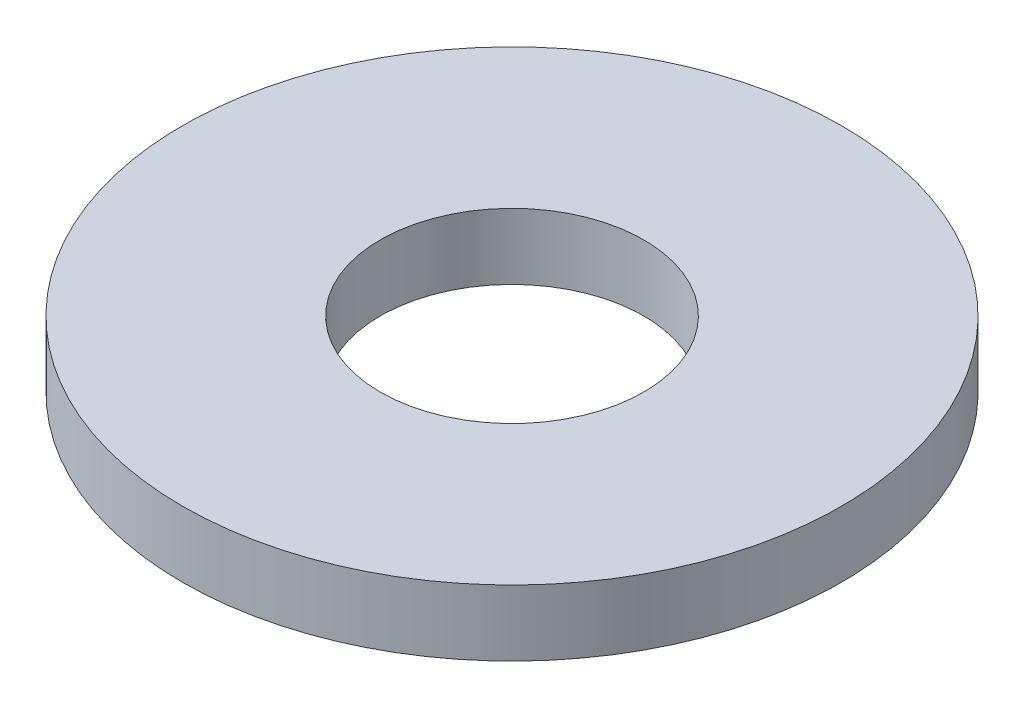
ISO-10303-21;
HEADER;
FILE_DESCRIPTION(('STEP AP214'),'2;1');
FILE_NAME('part.step','',(''),(''),'','','');
FILE_SCHEMA(('AUTOMOTIVE_DESIGN { 1 0 10303 214 1 1 1 1 }'));
ENDSEC;
DATA;
#1=APPLICATION_CONTEXT('core data for automotive mechanical design processes');
#2=APPLICATION_PROTOCOL_DEFINITION('international standard','automotive_design',2000,#1);
#3=PRODUCT_CONTEXT('',#1,'mechanical');
#4=PRODUCT('Part','Part','',(#3));
#5=PRODUCT_RELATED_PRODUCT_CATEGORY('part','',(#4));
#6=PRODUCT_DEFINITION_FORMATION('','',#4);
#7=PRODUCT_DEFINITION_CONTEXT('part definition',#1,'design');
#8=PRODUCT_DEFINITION('design','',#6,#7);
#9=PRODUCT_DEFINITION_SHAPE('','',#8);
#10=(LENGTH_UNIT() NAMED_UNIT(*) SI_UNIT(.MILLI.,.METRE.));
#11=(NAMED_UNIT(*) PLANE_ANGLE_UNIT() SI_UNIT($,.RADIAN.));
#12=(NAMED_UNIT(*) SI_UNIT($,.STERADIAN.) SOLID_ANGLE_UNIT());
#13=UNCERTAINTY_MEASURE_WITH_UNIT(LENGTH_MEASURE(1.E-05),#10,'distance_accuracy_value','');
#14=(GEOMETRIC_REPRESENTATION_CONTEXT(3) GLOBAL_UNCERTAINTY_ASSIGNED_CONTEXT((#13)) GLOBAL_UNIT_ASSIGNED_CONTEXT((#10,
#11,#12)) REPRESENTATION_CONTEXT('',''));
#15=CARTESIAN_POINT('',(0.,0.,0.));
#16=DIRECTION('',(0.,0.,1.));
#17=DIRECTION('',(1.,0.,0.));
#18=AXIS2_PLACEMENT_3D('',#15,#16,#17);
#19=CARTESIAN_POINT('',(0.,1.5875,0.));
#20=DIRECTION('',(0.,1.,0.));
#21=DIRECTION('',(0.,0.,1.));
#22=AXIS2_PLACEMENT_3D('',#19,#20,#21);
#23=PLANE('',#22);
#24=CARTESIAN_POINT('',(0.,1.5875,0.));
#25=DIRECTION('',(0.,1.,0.));
#26=DIRECTION('',(0.,0.,1.));
#27=AXIS2_PLACEMENT_3D('',#24,#25,#26);
#28=CIRCLE('',#27,7.9375);
#29=CARTESIAN_POINT('',(0.,1.5875,7.9375));
#30=VERTEX_POINT('',#29);
#31=EDGE_CURVE('E10',#30,#30,#28,.T.);
#32=ORIENTED_EDGE('',*,*,#31,.T.);
#33=EDGE_LOOP('',(#32));
#34=FACE_BOUND('',#33,.T.);
#35=CARTESIAN_POINT('',(0.,1.5875,0.));
#36=DIRECTION('',(0.,1.,0.));
#37=DIRECTION('',(0.,0.,1.));
#38=AXIS2_PLACEMENT_3D('',#35,#36,#37);
#39=CIRCLE('',#38,3.175);
#40=CARTESIAN_POINT('',(0.,1.5875,3.175));
#41=VERTEX_POINT('',#40);
#42=EDGE_CURVE('E42',#41,#41,#39,.T.);
#43=ORIENTED_EDGE('',*,*,#42,.F.);
#44=EDGE_LOOP('',(#43));
#45=FACE_BOUND('',#44,.T.);
#46=ADVANCED_FACE('F31',(#34,#45),#23,.T.);
#47=CARTESIAN_POINT('',(0.,0.,0.));
#48=DIRECTION('',(0.,1.,0.));
#49=DIRECTION('',(0.,0.,1.));
#50=AXIS2_PLACEMENT_3D('',#47,#48,#49);
#51=PLANE('',#50);
#52=CARTESIAN_POINT('',(0.,0.,0.));
#53=DIRECTION('',(0.,1.,0.));
#54=DIRECTION('',(0.,0.,1.));
#55=AXIS2_PLACEMENT_3D('',#52,#53,#54);
#56=CIRCLE('',#55,7.9375);
#57=CARTESIAN_POINT('',(0.,0.,7.9375));
#58=VERTEX_POINT('',#57);
#59=EDGE_CURVE('E35',#58,#58,#56,.T.);
#60=ORIENTED_EDGE('',*,*,#59,.F.);
#61=EDGE_LOOP('',(#60));
#62=FACE_BOUND('',#61,.T.);
#63=CARTESIAN_POINT('',(0.,0.,0.));
#64=DIRECTION('',(0.,1.,0.));
#65=DIRECTION('',(0.,0.,1.));
#66=AXIS2_PLACEMENT_3D('',#63,#64,#65);
#67=CIRCLE('',#66,3.175);
#68=CARTESIAN_POINT('',(0.,0.,3.175));
#69=VERTEX_POINT('',#68);
#70=EDGE_CURVE('E44',#69,#69,#67,.T.);
#71=ORIENTED_EDGE('',*,*,#70,.T.);
#72=EDGE_LOOP('',(#71));
#73=FACE_BOUND('',#72,.T.);
#74=ADVANCED_FACE('F54',(#62,#73),#51,.F.);
#75=CARTESIAN_POINT('',(0.,1.5875,0.));
#76=DIRECTION('',(0.,-1.,0.));
#77=DIRECTION('',(0.,0.,-1.));
#78=AXIS2_PLACEMENT_3D('',#75,#76,#77);
#79=CYLINDRICAL_SURFACE('',#78,7.9375);
#80=ORIENTED_EDGE('',*,*,#31,.F.);
#81=EDGE_LOOP('',(#80));
#82=FACE_BOUND('',#81,.T.);
#83=ORIENTED_EDGE('',*,*,#59,.T.);
#84=EDGE_LOOP('',(#83));
#85=FACE_BOUND('',#84,.T.);
#86=ADVANCED_FACE('F33',(#82,#85),#79,.T.);
#87=CARTESIAN_POINT('',(0.,1.5875,0.));
#88=DIRECTION('',(0.,-1.,0.));
#89=DIRECTION('',(0.,0.,-1.));
#90=AXIS2_PLACEMENT_3D('',#87,#88,#89);
#91=CYLINDRICAL_SURFACE('',#90,3.175);
#92=ORIENTED_EDGE('',*,*,#42,.T.);
#93=EDGE_LOOP('',(#92));
#94=FACE_BOUND('',#93,.T.);
#95=ORIENTED_EDGE('',*,*,#70,.F.);
#96=EDGE_LOOP('',(#95));
#97=FACE_BOUND('',#96,.T.);
#98=ADVANCED_FACE('F50',(#94,#97),#91,.F.);
#99=CLOSED_SHELL('',(#46,#74,#86,#98));
#100=MANIFOLD_SOLID_BREP('B2',#99);
#101=ADVANCED_BREP_SHAPE_REPRESENTATION('',(#18,#100),#14);
#102=SHAPE_DEFINITION_REPRESENTATION(#9,#101);
ENDSEC;
END-ISO-10303-21;
